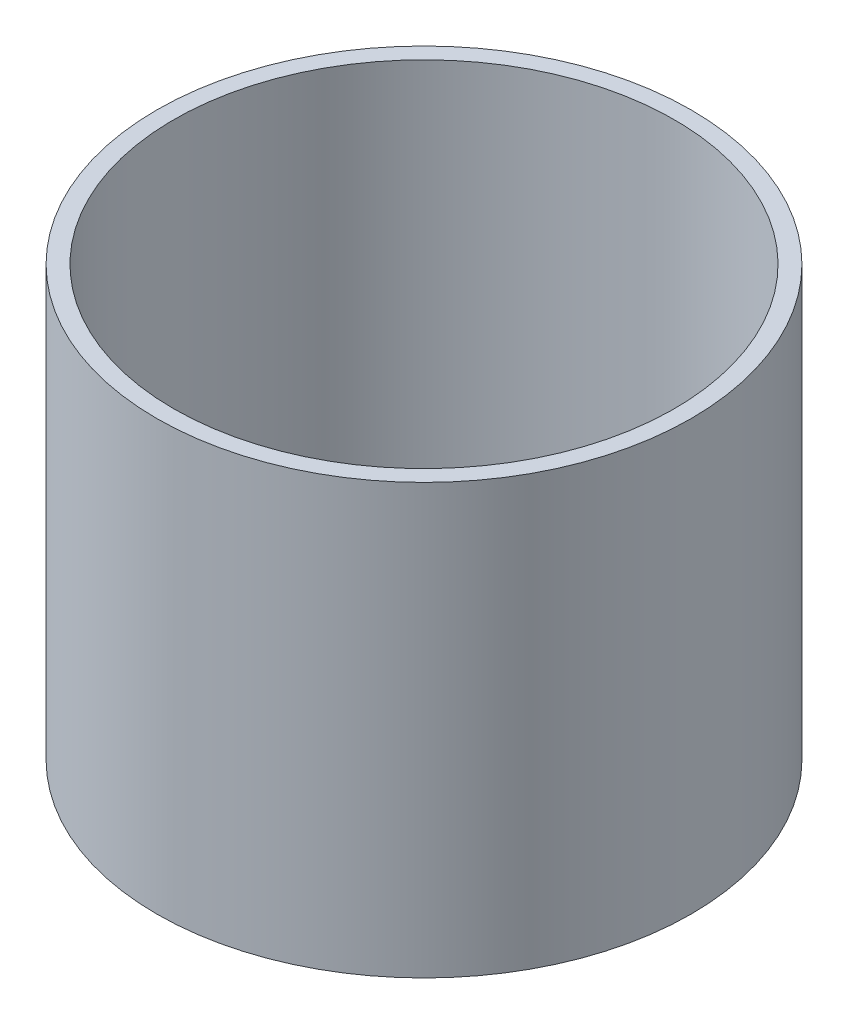
ISO-10303-21;
HEADER;
FILE_DESCRIPTION(('STEP AP214'),'2;1');
FILE_NAME('part.step','',(''),(''),'','','');
FILE_SCHEMA(('AUTOMOTIVE_DESIGN { 1 0 10303 214 1 1 1 1 }'));
ENDSEC;
DATA;
#1=APPLICATION_CONTEXT('core data for automotive mechanical design processes');
#2=APPLICATION_PROTOCOL_DEFINITION('international standard','automotive_design',2000,#1);
#3=PRODUCT_CONTEXT('',#1,'mechanical');
#4=PRODUCT('Part','Part','',(#3));
#5=PRODUCT_RELATED_PRODUCT_CATEGORY('part','',(#4));
#6=PRODUCT_DEFINITION_FORMATION('','',#4);
#7=PRODUCT_DEFINITION_CONTEXT('part definition',#1,'design');
#8=PRODUCT_DEFINITION('design','',#6,#7);
#9=PRODUCT_DEFINITION_SHAPE('','',#8);
#10=(LENGTH_UNIT() NAMED_UNIT(*) SI_UNIT(.MILLI.,.METRE.));
#11=(NAMED_UNIT(*) PLANE_ANGLE_UNIT() SI_UNIT($,.RADIAN.));
#12=(NAMED_UNIT(*) SI_UNIT($,.STERADIAN.) SOLID_ANGLE_UNIT());
#13=UNCERTAINTY_MEASURE_WITH_UNIT(LENGTH_MEASURE(1.E-05),#10,'distance_accuracy_value','');
#14=(GEOMETRIC_REPRESENTATION_CONTEXT(3) GLOBAL_UNCERTAINTY_ASSIGNED_CONTEXT((#13)) GLOBAL_UNIT_ASSIGNED_CONTEXT((#10,
#11,#12)) REPRESENTATION_CONTEXT('',''));
#15=CARTESIAN_POINT('',(0.,0.,0.));
#16=DIRECTION('',(0.,0.,1.));
#17=DIRECTION('',(1.,0.,0.));
#18=AXIS2_PLACEMENT_3D('',#15,#16,#17);
#19=CARTESIAN_POINT('',(0.,76.2,0.));
#20=DIRECTION('',(0.,1.,0.));
#21=DIRECTION('',(0.,0.,1.));
#22=AXIS2_PLACEMENT_3D('',#19,#20,#21);
#23=PLANE('',#22);
#24=CARTESIAN_POINT('',(0.,76.2,0.));
#25=DIRECTION('',(0.,1.,0.));
#26=DIRECTION('',(0.,0.,1.));
#27=AXIS2_PLACEMENT_3D('',#24,#25,#26);
#28=CIRCLE('',#27,47.449994);
#29=CARTESIAN_POINT('',(0.,76.2,47.449994));
#30=VERTEX_POINT('',#29);
#31=EDGE_CURVE('E10',#30,#30,#28,.T.);
#32=ORIENTED_EDGE('',*,*,#31,.T.);
#33=EDGE_LOOP('',(#32));
#34=FACE_BOUND('',#33,.T.);
#35=CARTESIAN_POINT('',(0.,76.2,0.));
#36=DIRECTION('',(0.,1.,0.));
#37=DIRECTION('',(0.,0.,1.));
#38=AXIS2_PLACEMENT_3D('',#35,#36,#37);
#39=CIRCLE('',#38,44.45);
#40=CARTESIAN_POINT('',(0.,76.2,44.45));
#41=VERTEX_POINT('',#40);
#42=EDGE_CURVE('E42',#41,#41,#39,.T.);
#43=ORIENTED_EDGE('',*,*,#42,.F.);
#44=EDGE_LOOP('',(#43));
#45=FACE_BOUND('',#44,.T.);
#46=ADVANCED_FACE('F31',(#34,#45),#23,.T.);
#47=CARTESIAN_POINT('',(0.,0.,0.));
#48=DIRECTION('',(0.,1.,0.));
#49=DIRECTION('',(0.,0.,1.));
#50=AXIS2_PLACEMENT_3D('',#47,#48,#49);
#51=PLANE('',#50);
#52=CARTESIAN_POINT('',(0.,0.,0.));
#53=DIRECTION('',(0.,1.,0.));
#54=DIRECTION('',(0.,0.,1.));
#55=AXIS2_PLACEMENT_3D('',#52,#53,#54);
#56=CIRCLE('',#55,47.449994);
#57=CARTESIAN_POINT('',(0.,0.,47.449994));
#58=VERTEX_POINT('',#57);
#59=EDGE_CURVE('E35',#58,#58,#56,.T.);
#60=ORIENTED_EDGE('',*,*,#59,.F.);
#61=EDGE_LOOP('',(#60));
#62=FACE_BOUND('',#61,.T.);
#63=CARTESIAN_POINT('',(0.,0.,0.));
#64=DIRECTION('',(0.,1.,0.));
#65=DIRECTION('',(0.,0.,1.));
#66=AXIS2_PLACEMENT_3D('',#63,#64,#65);
#67=CIRCLE('',#66,44.45);
#68=CARTESIAN_POINT('',(0.,0.,44.45));
#69=VERTEX_POINT('',#68);
#70=EDGE_CURVE('E44',#69,#69,#67,.T.);
#71=ORIENTED_EDGE('',*,*,#70,.T.);
#72=EDGE_LOOP('',(#71));
#73=FACE_BOUND('',#72,.T.);
#74=ADVANCED_FACE('F54',(#62,#73),#51,.F.);
#75=CARTESIAN_POINT('',(0.,76.2,0.));
#76=DIRECTION('',(0.,-1.,0.));
#77=DIRECTION('',(0.,0.,-1.));
#78=AXIS2_PLACEMENT_3D('',#75,#76,#77);
#79=CYLINDRICAL_SURFACE('',#78,47.449994);
#80=ORIENTED_EDGE('',*,*,#31,.F.);
#81=EDGE_LOOP('',(#80));
#82=FACE_BOUND('',#81,.T.);
#83=ORIENTED_EDGE('',*,*,#59,.T.);
#84=EDGE_LOOP('',(#83));
#85=FACE_BOUND('',#84,.T.);
#86=ADVANCED_FACE('F33',(#82,#85),#79,.T.);
#87=CARTESIAN_POINT('',(0.,76.2,0.));
#88=DIRECTION('',(0.,-1.,0.));
#89=DIRECTION('',(0.,0.,-1.));
#90=AXIS2_PLACEMENT_3D('',#87,#88,#89);
#91=CYLINDRICAL_SURFACE('',#90,44.45);
#92=ORIENTED_EDGE('',*,*,#42,.T.);
#93=EDGE_LOOP('',(#92));
#94=FACE_BOUND('',#93,.T.);
#95=ORIENTED_EDGE('',*,*,#70,.F.);
#96=EDGE_LOOP('',(#95));
#97=FACE_BOUND('',#96,.T.);
#98=ADVANCED_FACE('F50',(#94,#97),#91,.F.);
#99=CLOSED_SHELL('',(#46,#74,#86,#98));
#100=MANIFOLD_SOLID_BREP('B2',#99);
#101=ADVANCED_BREP_SHAPE_REPRESENTATION('',(#18,#100),#14);
#102=SHAPE_DEFINITION_REPRESENTATION(#9,#101);
ENDSEC;
END-ISO-10303-21;
